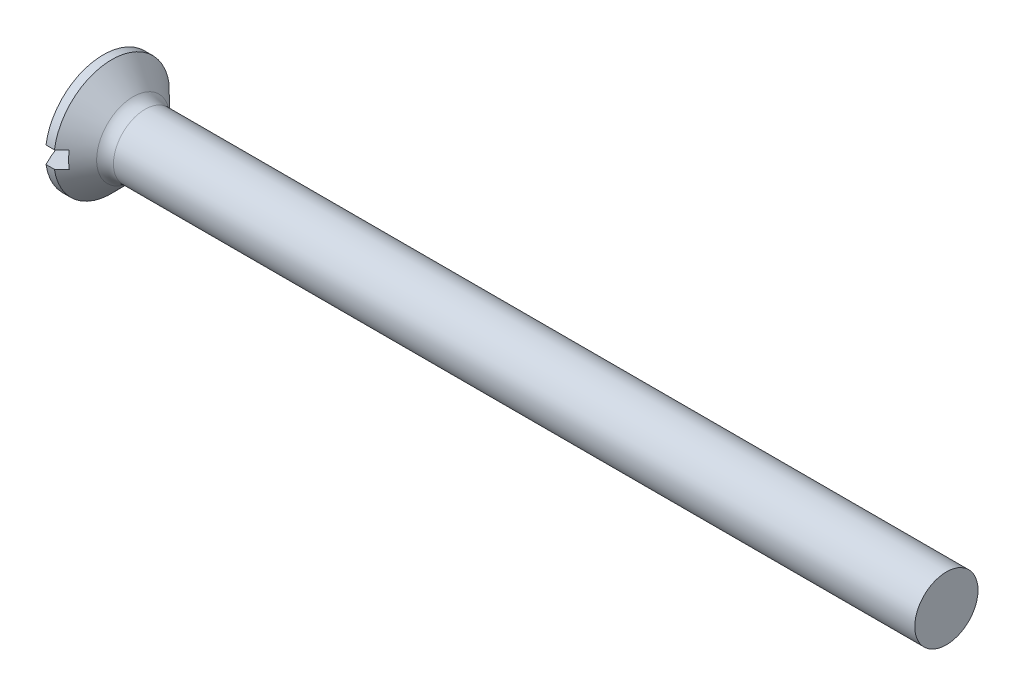
ISO-10303-21;
HEADER;
FILE_DESCRIPTION(('STEP AP214'),'2;1');
FILE_NAME('part.step','',(''),(''),'','','');
FILE_SCHEMA(('AUTOMOTIVE_DESIGN { 1 0 10303 214 1 1 1 1 }'));
ENDSEC;
DATA;
#1=APPLICATION_CONTEXT('core data for automotive mechanical design processes');
#2=APPLICATION_PROTOCOL_DEFINITION('international standard','automotive_design',2000,#1);
#3=PRODUCT_CONTEXT('',#1,'mechanical');
#4=PRODUCT('Part','Part','',(#3));
#5=PRODUCT_RELATED_PRODUCT_CATEGORY('part','',(#4));
#6=PRODUCT_DEFINITION_FORMATION('','',#4);
#7=PRODUCT_DEFINITION_CONTEXT('part definition',#1,'design');
#8=PRODUCT_DEFINITION('design','',#6,#7);
#9=PRODUCT_DEFINITION_SHAPE('','',#8);
#10=(LENGTH_UNIT() NAMED_UNIT(*) SI_UNIT(.MILLI.,.METRE.));
#11=(NAMED_UNIT(*) PLANE_ANGLE_UNIT() SI_UNIT($,.RADIAN.));
#12=(NAMED_UNIT(*) SI_UNIT($,.STERADIAN.) SOLID_ANGLE_UNIT());
#13=UNCERTAINTY_MEASURE_WITH_UNIT(LENGTH_MEASURE(1.E-05),#10,'distance_accuracy_value','');
#14=(GEOMETRIC_REPRESENTATION_CONTEXT(3) GLOBAL_UNCERTAINTY_ASSIGNED_CONTEXT((#13)) GLOBAL_UNIT_ASSIGNED_CONTEXT((#10,
#11,#12)) REPRESENTATION_CONTEXT('',''));
#15=CARTESIAN_POINT('',(0.,0.,0.));
#16=DIRECTION('',(0.,0.,1.));
#17=DIRECTION('',(1.,0.,0.));
#18=AXIS2_PLACEMENT_3D('',#15,#16,#17);
#19=CARTESIAN_POINT('',(5.75178571428571,0.,0.));
#20=DIRECTION('',(-1.,0.,0.));
#21=DIRECTION('',(0.,-1.,0.));
#22=AXIS2_PLACEMENT_3D('',#19,#20,#21);
#23=SPHERICAL_SURFACE('',#22,5.75178571428571);
#24=CARTESIAN_POINT('',(5.75178571428571,0.4,0.));
#25=DIRECTION('',(0.,1.,0.));
#26=DIRECTION('',(0.,0.,1.));
#27=AXIS2_PLACEMENT_3D('',#24,#25,#26);
#28=CIRCLE('',#27,5.73786013275517);
#29=CARTESIAN_POINT('',(0.699999999999999,0.4,2.72075357208256));
#30=VERTEX_POINT('',#29);
#31=CARTESIAN_POINT('',(0.699999999999999,0.4,-2.72075357208256));
#32=VERTEX_POINT('',#31);
#33=EDGE_CURVE('E180',#30,#32,#28,.F.);
#34=ORIENTED_EDGE('',*,*,#33,.F.);
#35=CARTESIAN_POINT('',(0.699999999999999,0.,0.));
#36=DIRECTION('',(-1.,0.,0.));
#37=DIRECTION('',(0.,0.,1.));
#38=AXIS2_PLACEMENT_3D('',#35,#36,#37);
#39=CIRCLE('',#38,2.75);
#40=EDGE_CURVE('E116',#30,#32,#39,.T.);
#41=ORIENTED_EDGE('',*,*,#40,.T.);
#42=EDGE_LOOP('',(#34,#41));
#43=FACE_BOUND('',#42,.T.);
#44=ADVANCED_FACE('F35',(#43),#23,.T.);
#45=CARTESIAN_POINT('',(-15.875,0.,0.));
#46=DIRECTION('',(-1.,0.,0.));
#47=DIRECTION('',(0.,0.,1.));
#48=AXIS2_PLACEMENT_3D('',#45,#46,#47);
#49=CYLINDRICAL_SURFACE('',#48,2.75);
#50=CARTESIAN_POINT('',(1.1,0.,0.));
#51=DIRECTION('',(-1.,0.,0.));
#52=DIRECTION('',(0.,0.,1.));
#53=AXIS2_PLACEMENT_3D('',#50,#51,#52);
#54=CIRCLE('',#53,2.75);
#55=CARTESIAN_POINT('',(1.1,0.4,2.72075357208256));
#56=VERTEX_POINT('',#55);
#57=CARTESIAN_POINT('',(1.1,0.4,-2.72075357208256));
#58=VERTEX_POINT('',#57);
#59=EDGE_CURVE('E110',#56,#58,#54,.T.);
#60=ORIENTED_EDGE('',*,*,#59,.T.);
#61=DIRECTION('',(-1.,0.,0.));
#62=VECTOR('',#61,1.);
#63=CARTESIAN_POINT('',(-15.875,0.4,-2.72075357208256));
#64=LINE('',#63,#62);
#65=EDGE_CURVE('E63',#58,#32,#64,.T.);
#66=ORIENTED_EDGE('',*,*,#65,.T.);
#67=ORIENTED_EDGE('',*,*,#40,.F.);
#68=DIRECTION('',(-1.,0.,0.));
#69=VECTOR('',#68,1.);
#70=CARTESIAN_POINT('',(-15.875,0.4,2.72075357208256));
#71=LINE('',#70,#69);
#72=EDGE_CURVE('E178',#30,#56,#71,.F.);
#73=ORIENTED_EDGE('',*,*,#72,.T.);
#74=EDGE_LOOP('',(#60,#66,#67,#73));
#75=FACE_BOUND('',#74,.T.);
#76=ADVANCED_FACE('F156',(#75),#49,.T.);
#77=CARTESIAN_POINT('',(5.75178571428571,-0.4,0.));
#78=DIRECTION('',(0.,-1.,0.));
#79=DIRECTION('',(0.,0.,-1.));
#80=AXIS2_PLACEMENT_3D('',#77,#78,#79);
#81=CIRCLE('',#80,5.73786013275517);
#82=CARTESIAN_POINT('',(0.699999999999999,-0.4,-2.72075357208256));
#83=VERTEX_POINT('',#82);
#84=CARTESIAN_POINT('',(0.699999999999999,-0.4,2.72075357208256));
#85=VERTEX_POINT('',#84);
#86=EDGE_CURVE('E170',#83,#85,#81,.F.);
#87=ORIENTED_EDGE('',*,*,#86,.F.);
#88=EDGE_CURVE('E112',#83,#85,#39,.T.);
#89=ORIENTED_EDGE('',*,*,#88,.T.);
#90=EDGE_LOOP('',(#87,#89));
#91=FACE_BOUND('',#90,.T.);
#92=ADVANCED_FACE('F158',(#91),#23,.T.);
#93=CARTESIAN_POINT('',(1.1,-0.4,-2.72075357208256));
#94=VERTEX_POINT('',#93);
#95=CARTESIAN_POINT('',(1.1,-0.4,2.72075357208256));
#96=VERTEX_POINT('',#95);
#97=EDGE_CURVE('E113',#94,#96,#54,.T.);
#98=ORIENTED_EDGE('',*,*,#97,.T.);
#99=DIRECTION('',(-1.,0.,0.));
#100=VECTOR('',#99,1.);
#101=CARTESIAN_POINT('',(-15.875,-0.4,2.72075357208256));
#102=LINE('',#101,#100);
#103=EDGE_CURVE('E173',#96,#85,#102,.T.);
#104=ORIENTED_EDGE('',*,*,#103,.T.);
#105=ORIENTED_EDGE('',*,*,#88,.F.);
#106=DIRECTION('',(-1.,0.,0.));
#107=VECTOR('',#106,1.);
#108=CARTESIAN_POINT('',(-15.875,-0.4,-2.72075357208256));
#109=LINE('',#108,#107);
#110=EDGE_CURVE('E174',#83,#94,#109,.F.);
#111=ORIENTED_EDGE('',*,*,#110,.T.);
#112=EDGE_LOOP('',(#98,#104,#105,#111));
#113=FACE_BOUND('',#112,.T.);
#114=ADVANCED_FACE('F153',(#113),#49,.T.);
#115=CARTESIAN_POINT('',(1.1,0.,0.));
#116=DIRECTION('',(-1.,0.,0.));
#117=DIRECTION('',(0.,0.,1.));
#118=AXIS2_PLACEMENT_3D('',#115,#116,#117);
#119=CONICAL_SURFACE('',#118,2.75,0.785398163397452);
#120=CARTESIAN_POINT('',(-2.20687506719363,0.4,-6.04365250321295));
#121=CARTESIAN_POINT('',(-1.99911791295739,0.4,-5.83543706816868));
#122=CARTESIAN_POINT('',(-1.79138070694892,0.4,-5.62720171024495));
#123=CARTESIAN_POINT('',(-1.37596790952366,0.4,-5.21066089973354));
#124=CARTESIAN_POINT('',(-1.16829231947986,0.4,-5.00235544577663));
#125=CARTESIAN_POINT('',(-0.752935195563237,0.4,-4.58555459209981));
#126=CARTESIAN_POINT('',(-0.545253705087096,0.4,-4.37705914913036));
#127=CARTESIAN_POINT('',(-0.130034329894821,0.4,-3.95993369416348));
#128=CARTESIAN_POINT('',(0.0775035576502857,0.4,-3.75130368498303));
#129=CARTESIAN_POINT('',(0.494407781570434,0.4,-3.33174989266188));
#130=CARTESIAN_POINT('',(0.703771859093176,0.4,-3.1208238648628));
#131=CARTESIAN_POINT('',(1.12211155953381,0.4,-2.6985614653926));
#132=CARTESIAN_POINT('',(1.33108715855867,0.4,-2.4872250700166));
#133=CARTESIAN_POINT('',(1.64388389817989,0.4,-2.16962535790697));
#134=CARTESIAN_POINT('',(1.74802293864373,0.4,-2.06367539317931));
#135=CARTESIAN_POINT('',(1.95596336871291,0.4,-1.85143960284149));
#136=CARTESIAN_POINT('',(2.05976475015577,0.4,-1.74515376923275));
#137=CARTESIAN_POINT('',(2.26679924709425,0.4,-1.53205090253776));
#138=CARTESIAN_POINT('',(2.37003242409393,0.4,-1.42523392942454));
#139=CARTESIAN_POINT('',(2.52407725733261,0.4,-1.26424160334649));
#140=CARTESIAN_POINT('',(2.57529039162472,0.4,-1.2104507370719));
#141=CARTESIAN_POINT('',(2.6773200398769,0.4,-1.10249450654719));
#142=CARTESIAN_POINT('',(2.72813655943351,0.4,-1.04832914760188));
#143=CARTESIAN_POINT('',(2.80606903249431,0.4,-0.96431949196232));
#144=CARTESIAN_POINT('',(2.83340075004673,0.4,-0.934675525328244));
#145=CARTESIAN_POINT('',(2.88782717855191,0.4,-0.87516947138572));
#146=CARTESIAN_POINT('',(2.91492188422776,0.4,-0.845307379247868));
#147=CARTESIAN_POINT('',(2.96879557439535,0.4,-0.785300565667671));
#148=CARTESIAN_POINT('',(2.9955745712291,0.4,-0.755155855356986));
#149=CARTESIAN_POINT('',(3.04869127920293,0.4,-0.694483953277072));
#150=CARTESIAN_POINT('',(3.07502901037371,0.4,-0.663956778979876));
#151=CARTESIAN_POINT('',(3.14025169732398,0.4,-0.58683168616397));
#152=CARTESIAN_POINT('',(3.17875545873879,0.4,-0.539904035770368));
#153=CARTESIAN_POINT('',(3.23456130499464,0.4,-0.467961902417084));
#154=CARTESIAN_POINT('',(3.2528450561914,0.4,-0.44371296155471));
#155=CARTESIAN_POINT('',(3.28843817843406,0.4,-0.394514061786013));
#156=CARTESIAN_POINT('',(3.30574783007905,0.4,-0.369564307892622));
#157=CARTESIAN_POINT('',(3.34204525545066,0.4,-0.313922402752042));
#158=CARTESIAN_POINT('',(3.36073582023279,0.4,-0.283033185985469));
#159=CARTESIAN_POINT('',(3.39460504959263,0.4,-0.219342045744406));
#160=CARTESIAN_POINT('',(3.40978976390097,0.4,-0.186543541327945));
#161=CARTESIAN_POINT('',(3.43021151429552,0.4,-0.129208992664752));
#162=CARTESIAN_POINT('',(3.43707356135637,0.4,-0.105274755579799));
#163=CARTESIAN_POINT('',(3.4467071154564,0.4,-0.0566326947192355));
#164=CARTESIAN_POINT('',(3.44949288913629,0.4,-0.0319278795646273));
#165=CARTESIAN_POINT('',(3.45038049815128,0.4,0.0176940962790907));
#166=CARTESIAN_POINT('',(3.44845909398932,0.4,0.0426117028461652));
#167=CARTESIAN_POINT('',(3.44033462081572,0.4,0.0917596818483829));
#168=CARTESIAN_POINT('',(3.43412006061588,0.4,0.115988027737383));
#169=CARTESIAN_POINT('',(3.41821974273151,0.4,0.164241751340462));
#170=CARTESIAN_POINT('',(3.40841190078597,0.4,0.188225005941298));
#171=CARTESIAN_POINT('',(3.38647762256258,0.4,0.235124707114331));
#172=CARTESIAN_POINT('',(3.37434697115713,0.4,0.258039118608782));
#173=CARTESIAN_POINT('',(3.34844412191649,0.4,0.303153601702649));
#174=CARTESIAN_POINT('',(3.33465931069165,0.4,0.325346298833456));
#175=CARTESIAN_POINT('',(3.30603668503229,0.4,0.369005903107241));
#176=CARTESIAN_POINT('',(3.29119978282362,0.4,0.39047341574706));
#177=CARTESIAN_POINT('',(3.24296344555378,0.4,0.457755220036415));
#178=CARTESIAN_POINT('',(3.20820599347252,0.4,0.502588412328851));
#179=CARTESIAN_POINT('',(3.13694507139462,0.4,0.59085368212503));
#180=CARTESIAN_POINT('',(3.1004404719726,0.4,0.634284822066964));
#181=CARTESIAN_POINT('',(3.02634037753113,0.4,0.720343724004835));
#182=CARTESIAN_POINT('',(2.98874300765706,0.4,0.762969869602562));
#183=CARTESIAN_POINT('',(2.91291592831248,0.4,0.847629579609184));
#184=CARTESIAN_POINT('',(2.87468640684534,0.4,0.889663313551352));
#185=CARTESIAN_POINT('',(2.75959651924667,0.4,1.01492951206667));
#186=CARTESIAN_POINT('',(2.68210812929094,0.4,1.09758392829678));
#187=CARTESIAN_POINT('',(2.52637558207673,0.4,1.26200363451889));
#188=CARTESIAN_POINT('',(2.44813232292423,0.4,1.34376978180012));
#189=CARTESIAN_POINT('',(2.29151509510831,0.4,1.50643852816013));
#190=CARTESIAN_POINT('',(2.21314346542552,0.4,1.58734337928878));
#191=CARTESIAN_POINT('',(2.05608715943503,0.4,1.74884883720661));
#192=CARTESIAN_POINT('',(1.97740248164938,0.4,1.82944944255587));
#193=CARTESIAN_POINT('',(1.74103566842239,0.4,2.07095119311857));
#194=CARTESIAN_POINT('',(1.58304383254659,0.4,2.23154909405026));
#195=CARTESIAN_POINT('',(1.26657499486529,0.4,2.55240298553709));
#196=CARTESIAN_POINT('',(1.1080978121286,0.4,2.71265879727666));
#197=CARTESIAN_POINT('',(0.790894688876694,0.4,3.03292106932729));
#198=CARTESIAN_POINT('',(0.632168750700887,0.4,3.19292753195545));
#199=CARTESIAN_POINT('',(0.155783351799206,0.4,3.67269610034978));
#200=CARTESIAN_POINT('',(-0.162105949218554,0.4,3.99222988669739));
#201=CARTESIAN_POINT('',(-0.798134188738984,0.4,4.63098060937503));
#202=CARTESIAN_POINT('',(-1.11627309687821,0.4,4.95019757595963));
#203=CARTESIAN_POINT('',(-1.56320218978185,0.4,5.39841195425106));
#204=CARTESIAN_POINT('',(-1.69192414545279,0.4,5.5274774006414));
#205=CARTESIAN_POINT('',(-1.94938617914346,0.4,5.78558230402054));
#206=CARTESIAN_POINT('',(-2.07812625648468,0.4,5.91462176168615));
#207=CARTESIAN_POINT('',(-2.20687506719363,0.4,6.04365250321294));
#208=B_SPLINE_CURVE_WITH_KNOTS('',3,(#120,#121,#122,#123,#124,#125,#126,#127,#128,#129,#130,
#131,#132,#133,#134,#135,#136,#137,#138,#139,#140,#141,#142,#143,#144,#145,#146,#147,#148,#149,
#150,#151,#152,#153,#154,#155,#156,#157,#158,#159,#160,#161,#162,#163,#164,#165,#166,#167,#168,
#169,#170,#171,#172,#173,#174,#175,#176,#177,#178,#179,#180,#181,#182,#183,#184,#185,#186,#187,
#188,#189,#190,#191,#192,#193,#194,#195,#196,#197,#198,#199,#200,#201,#202,#203,#204,#205,#206,
#207),.UNSPECIFIED.,.F.,.F.,(4,2,2,2,2,2,2,2,2,2,2,2,2,2,2,2,2,2,2,2,2,2,2,2,2,2,2,2,2,2,2,2,2,
2,2,2,2,2,2,2,2,2,2,4),(0.,0.882411670998373,1.76484171556897,2.64768796704176,3.53051630092901,
4.42209225744863,5.31372134637069,5.75940341917221,6.20509618690235,6.65073972348625,
6.87355282619033,7.09636277912197,7.21732492922553,7.33828976565758,7.45924985742287,
7.58020444339417,7.76224766050512,7.85334054485994,7.94440705325149,8.05261108892279,
8.16062698732482,8.23505770146545,8.30922728557388,8.38376378469999,8.45850056736451,
8.53605624120453,8.61375400995255,8.692087197356,8.77035327665499,8.94043177794591,
9.11062175021445,9.28112330630675,9.45157503568537,9.79145073140557,10.1309624951668,
10.4688800231388,10.806799148381,11.4826506760623,12.1587957716631,12.8349345461952,
14.1871171522788,15.5391550207074,16.0860051634555,16.6328385004407),.UNSPECIFIED.);
#209=CARTESIAN_POINT('',(1.45,0.4,2.36643191323985));
#210=VERTEX_POINT('',#209);
#211=EDGE_CURVE('E11',#210,#56,#208,.T.);
#212=ORIENTED_EDGE('',*,*,#211,.F.);
#213=CARTESIAN_POINT('',(1.45,0.,0.));
#214=DIRECTION('',(1.,0.,0.));
#215=DIRECTION('',(0.,0.,-1.));
#216=AXIS2_PLACEMENT_3D('',#213,#214,#215);
#217=CIRCLE('',#216,2.4);
#218=CARTESIAN_POINT('',(1.45,-0.4,2.36643191323985));
#219=VERTEX_POINT('',#218);
#220=EDGE_CURVE('E92',#219,#210,#217,.F.);
#221=ORIENTED_EDGE('',*,*,#220,.F.);
#222=CARTESIAN_POINT('',(-2.20687506719363,-0.400000000000001,6.04365250321295));
#223=CARTESIAN_POINT('',(-1.99911791295739,-0.400000000000001,5.83543706816868));
#224=CARTESIAN_POINT('',(-1.79138070694893,-0.400000000000001,5.62720171024495));
#225=CARTESIAN_POINT('',(-1.37596790952366,-0.400000000000001,5.21066089973355));
#226=CARTESIAN_POINT('',(-1.16829231947986,-0.400000000000001,5.00235544577663));
#227=CARTESIAN_POINT('',(-0.752935195563238,-0.4,4.58555459209981));
#228=CARTESIAN_POINT('',(-0.545253705087099,-0.4,4.37705914913036));
#229=CARTESIAN_POINT('',(-0.130034329894824,-0.4,3.95993369416348));
#230=CARTESIAN_POINT('',(0.0775035576502832,-0.4,3.75130368498303));
#231=CARTESIAN_POINT('',(0.494407781570432,-0.4,3.33174989266188));
#232=CARTESIAN_POINT('',(0.703771859093174,-0.4,3.12082386486281));
#233=CARTESIAN_POINT('',(1.12211155953381,-0.4,2.6985614653926));
#234=CARTESIAN_POINT('',(1.33108715855867,-0.4,2.4872250700166));
#235=CARTESIAN_POINT('',(1.64388389817989,-0.4,2.16962535790697));
#236=CARTESIAN_POINT('',(1.74802293864373,-0.4,2.06367539317931));
#237=CARTESIAN_POINT('',(1.95596336871291,-0.4,1.85143960284149));
#238=CARTESIAN_POINT('',(2.05976475015576,-0.4,1.74515376923275));
#239=CARTESIAN_POINT('',(2.26679924709425,-0.4,1.53205090253776));
#240=CARTESIAN_POINT('',(2.37003242409393,-0.4,1.42523392942454));
#241=CARTESIAN_POINT('',(2.52407725733261,-0.4,1.26424160334649));
#242=CARTESIAN_POINT('',(2.57529039162472,-0.4,1.2104507370719));
#243=CARTESIAN_POINT('',(2.6773200398769,-0.4,1.10249450654719));
#244=CARTESIAN_POINT('',(2.72813655943351,-0.4,1.04832914760188));
#245=CARTESIAN_POINT('',(2.80606903249431,-0.4,0.96431949196232));
#246=CARTESIAN_POINT('',(2.83340075004673,-0.4,0.934675525328243));
#247=CARTESIAN_POINT('',(2.88782717855191,-0.4,0.87516947138572));
#248=CARTESIAN_POINT('',(2.91492188422776,-0.4,0.845307379247868));
#249=CARTESIAN_POINT('',(2.96879557439535,-0.4,0.785300565667671));
#250=CARTESIAN_POINT('',(2.9955745712291,-0.4,0.755155855356986));
#251=CARTESIAN_POINT('',(3.04869127920293,-0.4,0.694483953277071));
#252=CARTESIAN_POINT('',(3.07502901037371,-0.4,0.663956778979875));
#253=CARTESIAN_POINT('',(3.14025169732398,-0.4,0.58683168616397));
#254=CARTESIAN_POINT('',(3.17875545873879,-0.4,0.539904035770368));
#255=CARTESIAN_POINT('',(3.23456130499464,-0.4,0.467961902417085));
#256=CARTESIAN_POINT('',(3.2528450561914,-0.4,0.443712961554712));
#257=CARTESIAN_POINT('',(3.28843817843406,-0.4,0.394514061786015));
#258=CARTESIAN_POINT('',(3.30574783007905,-0.4,0.369564307892624));
#259=CARTESIAN_POINT('',(3.34204525545066,-0.4,0.313922402752044));
#260=CARTESIAN_POINT('',(3.36073582023279,-0.4,0.283033185985471));
#261=CARTESIAN_POINT('',(3.39460504959263,-0.4,0.219342045744407));
#262=CARTESIAN_POINT('',(3.40978976390097,-0.4,0.186543541327946));
#263=CARTESIAN_POINT('',(3.43021151429552,-0.4,0.129208992664751));
#264=CARTESIAN_POINT('',(3.43707356135637,-0.4,0.105274755579799));
#265=CARTESIAN_POINT('',(3.4467071154564,-0.4,0.0566326947192352));
#266=CARTESIAN_POINT('',(3.44949288913629,-0.4,0.0319278795646269));
#267=CARTESIAN_POINT('',(3.45038049815128,-0.4,-0.0176940962790913));
#268=CARTESIAN_POINT('',(3.44845909398932,-0.4,-0.0426117028461661));
#269=CARTESIAN_POINT('',(3.44033462081572,-0.4,-0.0917596818483838));
#270=CARTESIAN_POINT('',(3.43412006061588,-0.4,-0.115988027737383));
#271=CARTESIAN_POINT('',(3.41821974273151,-0.4,-0.164241751340462));
#272=CARTESIAN_POINT('',(3.40841190078597,-0.4,-0.188225005941298));
#273=CARTESIAN_POINT('',(3.38647762256258,-0.4,-0.235124707114331));
#274=CARTESIAN_POINT('',(3.37434697115713,-0.4,-0.258039118608782));
#275=CARTESIAN_POINT('',(3.34844412191649,-0.4,-0.303153601702649));
#276=CARTESIAN_POINT('',(3.33465931069165,-0.4,-0.325346298833456));
#277=CARTESIAN_POINT('',(3.30603668503229,-0.4,-0.369005903107242));
#278=CARTESIAN_POINT('',(3.29119978282362,-0.4,-0.39047341574706));
#279=CARTESIAN_POINT('',(3.24296344555378,-0.4,-0.457755220036415));
#280=CARTESIAN_POINT('',(3.20820599347252,-0.4,-0.502588412328851));
#281=CARTESIAN_POINT('',(3.13694507139462,-0.4,-0.59085368212503));
#282=CARTESIAN_POINT('',(3.1004404719726,-0.4,-0.634284822066965));
#283=CARTESIAN_POINT('',(3.02634037753113,-0.4,-0.720343724004837));
#284=CARTESIAN_POINT('',(2.98874300765705,-0.4,-0.762969869602564));
#285=CARTESIAN_POINT('',(2.91291592831248,-0.4,-0.847629579609186));
#286=CARTESIAN_POINT('',(2.87468640684534,-0.4,-0.889663313551354));
#287=CARTESIAN_POINT('',(2.75959651924666,-0.4,-1.01492951206667));
#288=CARTESIAN_POINT('',(2.68210812929094,-0.4,-1.09758392829679));
#289=CARTESIAN_POINT('',(2.52637558207672,-0.4,-1.26200363451889));
#290=CARTESIAN_POINT('',(2.44813232292422,-0.4,-1.34376978180012));
#291=CARTESIAN_POINT('',(2.29151509510831,-0.4,-1.50643852816013));
#292=CARTESIAN_POINT('',(2.21314346542552,-0.4,-1.58734337928879));
#293=CARTESIAN_POINT('',(2.05608715943503,-0.4,-1.74884883720661));
#294=CARTESIAN_POINT('',(1.97740248164937,-0.4,-1.82944944255587));
#295=CARTESIAN_POINT('',(1.74103566842239,-0.4,-2.07095119311857));
#296=CARTESIAN_POINT('',(1.58304383254659,-0.4,-2.23154909405027));
#297=CARTESIAN_POINT('',(1.26657499486528,-0.4,-2.5524029855371));
#298=CARTESIAN_POINT('',(1.10809781212859,-0.4,-2.71265879727667));
#299=CARTESIAN_POINT('',(0.790894688876686,-0.4,-3.0329210693273));
#300=CARTESIAN_POINT('',(0.632168750700878,-0.4,-3.19292753195546));
#301=CARTESIAN_POINT('',(0.155783351799196,-0.4,-3.67269610034979));
#302=CARTESIAN_POINT('',(-0.162105949218565,-0.4,-3.9922298866974));
#303=CARTESIAN_POINT('',(-0.798134188738997,-0.399999999999999,-4.63098060937505));
#304=CARTESIAN_POINT('',(-1.11627309687823,-0.399999999999999,-4.95019757595964));
#305=CARTESIAN_POINT('',(-1.56320218978186,-0.399999999999999,-5.39841195425107));
#306=CARTESIAN_POINT('',(-1.6919241454528,-0.399999999999999,-5.52747740064141));
#307=CARTESIAN_POINT('',(-1.94938617914347,-0.399999999999999,-5.78558230402055));
#308=CARTESIAN_POINT('',(-2.07812625648469,-0.399999999999999,-5.91462176168616));
#309=CARTESIAN_POINT('',(-2.20687506719363,-0.399999999999999,-6.04365250321295));
#310=B_SPLINE_CURVE_WITH_KNOTS('',3,(#222,#223,#224,#225,#226,#227,#228,#229,#230,#231,#232,
#233,#234,#235,#236,#237,#238,#239,#240,#241,#242,#243,#244,#245,#246,#247,#248,#249,#250,#251,
#252,#253,#254,#255,#256,#257,#258,#259,#260,#261,#262,#263,#264,#265,#266,#267,#268,#269,#270,
#271,#272,#273,#274,#275,#276,#277,#278,#279,#280,#281,#282,#283,#284,#285,#286,#287,#288,#289,
#290,#291,#292,#293,#294,#295,#296,#297,#298,#299,#300,#301,#302,#303,#304,#305,#306,#307,#308,
#309),.UNSPECIFIED.,.F.,.F.,(4,2,2,2,2,2,2,2,2,2,2,2,2,2,2,2,2,2,2,2,2,2,2,2,2,2,2,2,2,2,2,2,2,
2,2,2,2,2,2,2,2,2,2,4),(0.,0.882411670998372,1.76484171556897,2.64768796704176,3.530516300929,
4.42209225744862,5.31372134637069,5.75940341917221,6.20509618690236,6.65073972348625,
6.87355282619033,7.09636277912197,7.21732492922553,7.33828976565758,7.45924985742288,
7.58020444339417,7.76224766050512,7.85334054485994,7.94440705325149,8.05261108892279,
8.16062698732483,8.23505770146545,8.30922728557388,8.38376378469999,8.45850056736451,
8.53605624120453,8.61375400995255,8.692087197356,8.77035327665499,8.94043177794591,
9.11062175021445,9.28112330630675,9.45157503568537,9.79145073140557,10.1309624951668,
10.4688800231388,10.806799148381,11.4826506760623,12.1587957716631,12.8349345461952,
14.1871171522788,15.5391550207074,16.0860051634555,16.6328385004407),.UNSPECIFIED.);
#311=EDGE_CURVE('E49',#96,#219,#310,.T.);
#312=ORIENTED_EDGE('',*,*,#311,.F.);
#313=ORIENTED_EDGE('',*,*,#97,.F.);
#314=CARTESIAN_POINT('',(1.45,-0.4,-2.36643191323985));
#315=VERTEX_POINT('',#314);
#316=EDGE_CURVE('E127',#315,#94,#310,.T.);
#317=ORIENTED_EDGE('',*,*,#316,.F.);
#318=CARTESIAN_POINT('',(1.45,0.4,-2.36643191323985));
#319=VERTEX_POINT('',#318);
#320=EDGE_CURVE('E100',#319,#315,#217,.F.);
#321=ORIENTED_EDGE('',*,*,#320,.F.);
#322=EDGE_CURVE('E39',#58,#319,#208,.T.);
#323=ORIENTED_EDGE('',*,*,#322,.F.);
#324=ORIENTED_EDGE('',*,*,#59,.F.);
#325=EDGE_LOOP('',(#212,#221,#312,#313,#317,#321,#323,#324));
#326=FACE_BOUND('',#325,.T.);
#327=CARTESIAN_POINT('',(2.11568542494923,0.,0.));
#328=DIRECTION('',(1.,0.,0.));
#329=DIRECTION('',(0.,0.,-1.));
#330=AXIS2_PLACEMENT_3D('',#327,#328,#329);
#331=CIRCLE('',#330,1.73431457505076);
#332=CARTESIAN_POINT('',(2.11568542494923,0.,-1.73431457505076));
#333=VERTEX_POINT('',#332);
#334=EDGE_CURVE('E122',#333,#333,#331,.F.);
#335=ORIENTED_EDGE('',*,*,#334,.T.);
#336=EDGE_LOOP('',(#335));
#337=FACE_BOUND('',#336,.T.);
#338=ADVANCED_FACE('F107',(#326,#337),#119,.T.);
#339=CARTESIAN_POINT('',(-15.875,0.,0.));
#340=DIRECTION('',(-1.,0.,0.));
#341=DIRECTION('',(0.,0.,1.));
#342=AXIS2_PLACEMENT_3D('',#339,#340,#341);
#343=CYLINDRICAL_SURFACE('',#342,1.5);
#344=CARTESIAN_POINT('',(2.68137084989847,0.,0.));
#345=DIRECTION('',(-1.,0.,0.));
#346=DIRECTION('',(0.,0.,1.));
#347=AXIS2_PLACEMENT_3D('',#344,#345,#346);
#348=CIRCLE('',#347,1.5);
#349=CARTESIAN_POINT('',(2.68137084989847,0.,1.5));
#350=VERTEX_POINT('',#349);
#351=EDGE_CURVE('E125',#350,#350,#348,.F.);
#352=ORIENTED_EDGE('',*,*,#351,.T.);
#353=EDGE_LOOP('',(#352));
#354=FACE_BOUND('',#353,.T.);
#355=CARTESIAN_POINT('',(40.7,0.,0.));
#356=DIRECTION('',(1.,0.,0.));
#357=DIRECTION('',(0.,0.,-1.));
#358=AXIS2_PLACEMENT_3D('',#355,#356,#357);
#359=CIRCLE('',#358,1.5);
#360=CARTESIAN_POINT('',(40.7,0.,-1.5));
#361=VERTEX_POINT('',#360);
#362=EDGE_CURVE('E104',#361,#361,#359,.T.);
#363=ORIENTED_EDGE('',*,*,#362,.F.);
#364=EDGE_LOOP('',(#363));
#365=FACE_BOUND('',#364,.T.);
#366=ADVANCED_FACE('F143',(#354,#365),#343,.T.);
#367=CARTESIAN_POINT('',(2.68137084989847,0.,0.));
#368=DIRECTION('',(-1.,0.,0.));
#369=DIRECTION('',(0.,0.,1.));
#370=AXIS2_PLACEMENT_3D('',#367,#368,#369);
#371=TOROIDAL_SURFACE('',#370,2.3,0.8);
#372=ORIENTED_EDGE('',*,*,#351,.F.);
#373=EDGE_LOOP('',(#372));
#374=FACE_BOUND('',#373,.T.);
#375=ORIENTED_EDGE('',*,*,#334,.F.);
#376=EDGE_LOOP('',(#375));
#377=FACE_BOUND('',#376,.T.);
#378=ADVANCED_FACE('F37',(#374,#377),#371,.F.);
#379=CARTESIAN_POINT('',(1.45,0.4,2.75));
#380=DIRECTION('',(0.,1.,0.));
#381=DIRECTION('',(0.,0.,1.));
#382=AXIS2_PLACEMENT_3D('',#379,#380,#381);
#383=PLANE('',#382);
#384=ORIENTED_EDGE('',*,*,#322,.T.);
#385=DIRECTION('',(0.,0.,-1.));
#386=VECTOR('',#385,1.);
#387=CARTESIAN_POINT('',(1.45,0.4,2.75));
#388=LINE('',#387,#386);
#389=EDGE_CURVE('E56',#210,#319,#388,.T.);
#390=ORIENTED_EDGE('',*,*,#389,.F.);
#391=ORIENTED_EDGE('',*,*,#211,.T.);
#392=ORIENTED_EDGE('',*,*,#72,.F.);
#393=ORIENTED_EDGE('',*,*,#33,.T.);
#394=ORIENTED_EDGE('',*,*,#65,.F.);
#395=EDGE_LOOP('',(#384,#390,#391,#392,#393,#394));
#396=FACE_BOUND('',#395,.T.);
#397=ADVANCED_FACE('F101',(#396),#383,.F.);
#398=CARTESIAN_POINT('',(1.45,-0.4,-2.75));
#399=DIRECTION('',(0.,-1.,0.));
#400=DIRECTION('',(0.,0.,-1.));
#401=AXIS2_PLACEMENT_3D('',#398,#399,#400);
#402=PLANE('',#401);
#403=ORIENTED_EDGE('',*,*,#311,.T.);
#404=DIRECTION('',(0.,0.,1.));
#405=VECTOR('',#404,1.);
#406=CARTESIAN_POINT('',(1.45,-0.4,-2.75));
#407=LINE('',#406,#405);
#408=EDGE_CURVE('E95',#315,#219,#407,.T.);
#409=ORIENTED_EDGE('',*,*,#408,.F.);
#410=ORIENTED_EDGE('',*,*,#316,.T.);
#411=ORIENTED_EDGE('',*,*,#110,.F.);
#412=ORIENTED_EDGE('',*,*,#86,.T.);
#413=ORIENTED_EDGE('',*,*,#103,.F.);
#414=EDGE_LOOP('',(#403,#409,#410,#411,#412,#413));
#415=FACE_BOUND('',#414,.T.);
#416=ADVANCED_FACE('F135',(#415),#402,.F.);
#417=CARTESIAN_POINT('',(1.45,-0.4,-2.75));
#418=DIRECTION('',(1.,0.,0.));
#419=DIRECTION('',(0.,0.,-1.));
#420=AXIS2_PLACEMENT_3D('',#417,#418,#419);
#421=PLANE('',#420);
#422=ORIENTED_EDGE('',*,*,#220,.T.);
#423=ORIENTED_EDGE('',*,*,#389,.T.);
#424=ORIENTED_EDGE('',*,*,#320,.T.);
#425=ORIENTED_EDGE('',*,*,#408,.T.);
#426=EDGE_LOOP('',(#422,#423,#424,#425));
#427=FACE_BOUND('',#426,.T.);
#428=ADVANCED_FACE('F93',(#427),#421,.F.);
#429=CARTESIAN_POINT('',(40.7,0.,0.));
#430=DIRECTION('',(1.,0.,0.));
#431=DIRECTION('',(0.,0.,-1.));
#432=AXIS2_PLACEMENT_3D('',#429,#430,#431);
#433=PLANE('',#432);
#434=ORIENTED_EDGE('',*,*,#362,.T.);
#435=EDGE_LOOP('',(#434));
#436=FACE_BOUND('',#435,.T.);
#437=ADVANCED_FACE('F190',(#436),#433,.T.);
#438=CLOSED_SHELL('',(#44,#76,#92,#114,#338,#366,#378,#397,#416,#428,#437));
#439=MANIFOLD_SOLID_BREP('B2',#438);
#440=ADVANCED_BREP_SHAPE_REPRESENTATION('',(#18,#439),#14);
#441=SHAPE_DEFINITION_REPRESENTATION(#9,#440);
ENDSEC;
END-ISO-10303-21;
